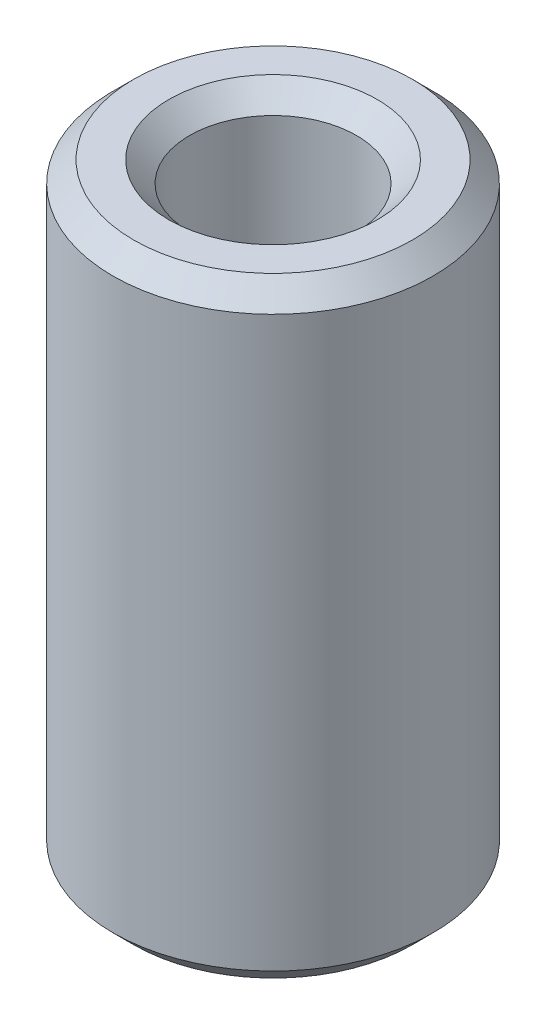
ISO-10303-21;
HEADER;
FILE_DESCRIPTION(('STEP AP214'),'2;1');
FILE_NAME('part.step','',(''),(''),'','','');
FILE_SCHEMA(('AUTOMOTIVE_DESIGN { 1 0 10303 214 1 1 1 1 }'));
ENDSEC;
DATA;
#1=APPLICATION_CONTEXT('core data for automotive mechanical design processes');
#2=APPLICATION_PROTOCOL_DEFINITION('international standard','automotive_design',2000,#1);
#3=PRODUCT_CONTEXT('',#1,'mechanical');
#4=PRODUCT('Part','Part','',(#3));
#5=PRODUCT_RELATED_PRODUCT_CATEGORY('part','',(#4));
#6=PRODUCT_DEFINITION_FORMATION('','',#4);
#7=PRODUCT_DEFINITION_CONTEXT('part definition',#1,'design');
#8=PRODUCT_DEFINITION('design','',#6,#7);
#9=PRODUCT_DEFINITION_SHAPE('','',#8);
#10=(LENGTH_UNIT() NAMED_UNIT(*) SI_UNIT(.MILLI.,.METRE.));
#11=(NAMED_UNIT(*) PLANE_ANGLE_UNIT() SI_UNIT($,.RADIAN.));
#12=(NAMED_UNIT(*) SI_UNIT($,.STERADIAN.) SOLID_ANGLE_UNIT());
#13=UNCERTAINTY_MEASURE_WITH_UNIT(LENGTH_MEASURE(1.E-05),#10,'distance_accuracy_value','');
#14=(GEOMETRIC_REPRESENTATION_CONTEXT(3) GLOBAL_UNCERTAINTY_ASSIGNED_CONTEXT((#13)) GLOBAL_UNIT_ASSIGNED_CONTEXT((#10,
#11,#12)) REPRESENTATION_CONTEXT('',''));
#15=CARTESIAN_POINT('',(0.,0.,0.));
#16=DIRECTION('',(0.,0.,1.));
#17=DIRECTION('',(1.,0.,0.));
#18=AXIS2_PLACEMENT_3D('',#15,#16,#17);
#19=CARTESIAN_POINT('',(0.,76.2451082855493,0.));
#20=DIRECTION('',(0.,-1.,0.));
#21=DIRECTION('',(0.,0.,-1.));
#22=AXIS2_PLACEMENT_3D('',#19,#20,#21);
#23=CYLINDRICAL_SURFACE('',#22,20.);
#24=CARTESIAN_POINT('',(0.,2.59481346662081,0.));
#25=DIRECTION('',(0.,1.,0.));
#26=DIRECTION('',(0.,0.,1.));
#27=AXIS2_PLACEMENT_3D('',#24,#25,#26);
#28=CIRCLE('',#27,20.);
#29=CARTESIAN_POINT('',(0.,2.59481346662081,20.));
#30=VERTEX_POINT('',#29);
#31=EDGE_CURVE('E10',#30,#30,#28,.T.);
#32=ORIENTED_EDGE('',*,*,#31,.T.);
#33=EDGE_LOOP('',(#32));
#34=FACE_BOUND('',#33,.T.);
#35=CARTESIAN_POINT('',(0.,73.6502948189284,0.));
#36=DIRECTION('',(0.,1.,0.));
#37=DIRECTION('',(0.,0.,1.));
#38=AXIS2_PLACEMENT_3D('',#35,#36,#37);
#39=CIRCLE('',#38,20.);
#40=CARTESIAN_POINT('',(0.,73.6502948189284,20.));
#41=VERTEX_POINT('',#40);
#42=EDGE_CURVE('E50',#41,#41,#39,.F.);
#43=ORIENTED_EDGE('',*,*,#42,.T.);
#44=EDGE_LOOP('',(#43));
#45=FACE_BOUND('',#44,.T.);
#46=ADVANCED_FACE('F39',(#34,#45),#23,.T.);
#47=CARTESIAN_POINT('',(0.,76.2451082855493,0.));
#48=DIRECTION('',(0.,1.,0.));
#49=DIRECTION('',(0.,0.,1.));
#50=AXIS2_PLACEMENT_3D('',#47,#48,#49);
#51=PLANE('',#50);
#52=CARTESIAN_POINT('',(0.,76.2451082855493,0.));
#53=DIRECTION('',(0.,1.,0.));
#54=DIRECTION('',(0.,0.,1.));
#55=AXIS2_PLACEMENT_3D('',#52,#53,#54);
#56=CIRCLE('',#55,13.0228428283634);
#57=CARTESIAN_POINT('',(0.,76.2451082855493,13.0228428283634));
#58=VERTEX_POINT('',#57);
#59=EDGE_CURVE('E58',#58,#58,#56,.F.);
#60=ORIENTED_EDGE('',*,*,#59,.T.);
#61=EDGE_LOOP('',(#60));
#62=FACE_BOUND('',#61,.T.);
#63=CARTESIAN_POINT('',(0.,76.2451082855493,0.));
#64=DIRECTION('',(0.,1.,0.));
#65=DIRECTION('',(0.,0.,1.));
#66=AXIS2_PLACEMENT_3D('',#63,#64,#65);
#67=CIRCLE('',#66,17.4051865333792);
#68=CARTESIAN_POINT('',(0.,76.2451082855493,17.4051865333792));
#69=VERTEX_POINT('',#68);
#70=EDGE_CURVE('E61',#69,#69,#67,.T.);
#71=ORIENTED_EDGE('',*,*,#70,.T.);
#72=EDGE_LOOP('',(#71));
#73=FACE_BOUND('',#72,.T.);
#74=ADVANCED_FACE('F88',(#62,#73),#51,.T.);
#75=CARTESIAN_POINT('',(0.,0.,0.));
#76=DIRECTION('',(0.,1.,0.));
#77=DIRECTION('',(0.,0.,1.));
#78=AXIS2_PLACEMENT_3D('',#75,#76,#77);
#79=PLANE('',#78);
#80=CARTESIAN_POINT('',(0.,0.,0.));
#81=DIRECTION('',(0.,1.,0.));
#82=DIRECTION('',(0.,0.,1.));
#83=AXIS2_PLACEMENT_3D('',#80,#81,#82);
#84=CIRCLE('',#83,13.0228428283634);
#85=CARTESIAN_POINT('',(0.,0.,13.0228428283634));
#86=VERTEX_POINT('',#85);
#87=EDGE_CURVE('E51',#86,#86,#84,.T.);
#88=ORIENTED_EDGE('',*,*,#87,.T.);
#89=EDGE_LOOP('',(#88));
#90=FACE_BOUND('',#89,.T.);
#91=CARTESIAN_POINT('',(0.,0.,0.));
#92=DIRECTION('',(0.,1.,0.));
#93=DIRECTION('',(0.,0.,1.));
#94=AXIS2_PLACEMENT_3D('',#91,#92,#93);
#95=CIRCLE('',#94,17.4051865333792);
#96=CARTESIAN_POINT('',(0.,0.,17.4051865333792));
#97=VERTEX_POINT('',#96);
#98=EDGE_CURVE('E54',#97,#97,#95,.F.);
#99=ORIENTED_EDGE('',*,*,#98,.T.);
#100=EDGE_LOOP('',(#99));
#101=FACE_BOUND('',#100,.T.);
#102=ADVANCED_FACE('F83',(#90,#101),#79,.F.);
#103=CARTESIAN_POINT('',(0.,76.2451082855493,0.));
#104=DIRECTION('',(0.,-1.,0.));
#105=DIRECTION('',(0.,0.,-1.));
#106=AXIS2_PLACEMENT_3D('',#103,#104,#105);
#107=CYLINDRICAL_SURFACE('',#106,10.4280293617426);
#108=CARTESIAN_POINT('',(0.,73.6502948189285,0.));
#109=DIRECTION('',(0.,1.,0.));
#110=DIRECTION('',(0.,0.,1.));
#111=AXIS2_PLACEMENT_3D('',#108,#109,#110);
#112=CIRCLE('',#111,10.4280293617426);
#113=CARTESIAN_POINT('',(0.,73.6502948189285,10.4280293617426));
#114=VERTEX_POINT('',#113);
#115=EDGE_CURVE('E67',#114,#114,#112,.T.);
#116=ORIENTED_EDGE('',*,*,#115,.T.);
#117=EDGE_LOOP('',(#116));
#118=FACE_BOUND('',#117,.T.);
#119=CARTESIAN_POINT('',(0.,2.59481346662084,0.));
#120=DIRECTION('',(0.,1.,0.));
#121=DIRECTION('',(0.,0.,1.));
#122=AXIS2_PLACEMENT_3D('',#119,#120,#121);
#123=CIRCLE('',#122,10.4280293617426);
#124=CARTESIAN_POINT('',(0.,2.59481346662084,10.4280293617426));
#125=VERTEX_POINT('',#124);
#126=EDGE_CURVE('E69',#125,#125,#123,.F.);
#127=ORIENTED_EDGE('',*,*,#126,.T.);
#128=EDGE_LOOP('',(#127));
#129=FACE_BOUND('',#128,.T.);
#130=ADVANCED_FACE('F71',(#118,#129),#107,.F.);
#131=CARTESIAN_POINT('',(0.,73.6502948189285,0.));
#132=DIRECTION('',(0.,1.,0.));
#133=DIRECTION('',(0.,0.,1.));
#134=AXIS2_PLACEMENT_3D('',#131,#132,#133);
#135=CONICAL_SURFACE('',#134,10.4280293617426,0.78539816339745);
#136=ORIENTED_EDGE('',*,*,#59,.F.);
#137=EDGE_LOOP('',(#136));
#138=FACE_BOUND('',#137,.T.);
#139=ORIENTED_EDGE('',*,*,#115,.F.);
#140=EDGE_LOOP('',(#139));
#141=FACE_BOUND('',#140,.T.);
#142=ADVANCED_FACE('F77',(#138,#141),#135,.F.);
#143=CARTESIAN_POINT('',(0.,0.,0.));
#144=DIRECTION('',(0.,-1.,0.));
#145=DIRECTION('',(0.,0.,-1.));
#146=AXIS2_PLACEMENT_3D('',#143,#144,#145);
#147=CONICAL_SURFACE('',#146,13.0228428283634,0.785398163397444);
#148=ORIENTED_EDGE('',*,*,#126,.F.);
#149=EDGE_LOOP('',(#148));
#150=FACE_BOUND('',#149,.T.);
#151=ORIENTED_EDGE('',*,*,#87,.F.);
#152=EDGE_LOOP('',(#151));
#153=FACE_BOUND('',#152,.T.);
#154=ADVANCED_FACE('F73',(#150,#153),#147,.F.);
#155=CARTESIAN_POINT('',(0.,2.59481346662081,0.));
#156=DIRECTION('',(0.,1.,0.));
#157=DIRECTION('',(0.,0.,1.));
#158=AXIS2_PLACEMENT_3D('',#155,#156,#157);
#159=CONICAL_SURFACE('',#158,20.,0.785398163397449);
#160=ORIENTED_EDGE('',*,*,#98,.F.);
#161=EDGE_LOOP('',(#160));
#162=FACE_BOUND('',#161,.T.);
#163=ORIENTED_EDGE('',*,*,#31,.F.);
#164=EDGE_LOOP('',(#163));
#165=FACE_BOUND('',#164,.T.);
#166=ADVANCED_FACE('F76',(#162,#165),#159,.T.);
#167=CARTESIAN_POINT('',(0.,76.2451082855493,0.));
#168=DIRECTION('',(0.,-1.,0.));
#169=DIRECTION('',(0.,0.,-1.));
#170=AXIS2_PLACEMENT_3D('',#167,#168,#169);
#171=CONICAL_SURFACE('',#170,17.4051865333792,0.785398163397442);
#172=ORIENTED_EDGE('',*,*,#42,.F.);
#173=EDGE_LOOP('',(#172));
#174=FACE_BOUND('',#173,.T.);
#175=ORIENTED_EDGE('',*,*,#70,.F.);
#176=EDGE_LOOP('',(#175));
#177=FACE_BOUND('',#176,.T.);
#178=ADVANCED_FACE('F45',(#174,#177),#171,.T.);
#179=CLOSED_SHELL('',(#46,#74,#102,#130,#142,#154,#166,#178));
#180=MANIFOLD_SOLID_BREP('B2',#179);
#181=ADVANCED_BREP_SHAPE_REPRESENTATION('',(#18,#180),#14);
#182=SHAPE_DEFINITION_REPRESENTATION(#9,#181);
ENDSEC;
END-ISO-10303-21;
